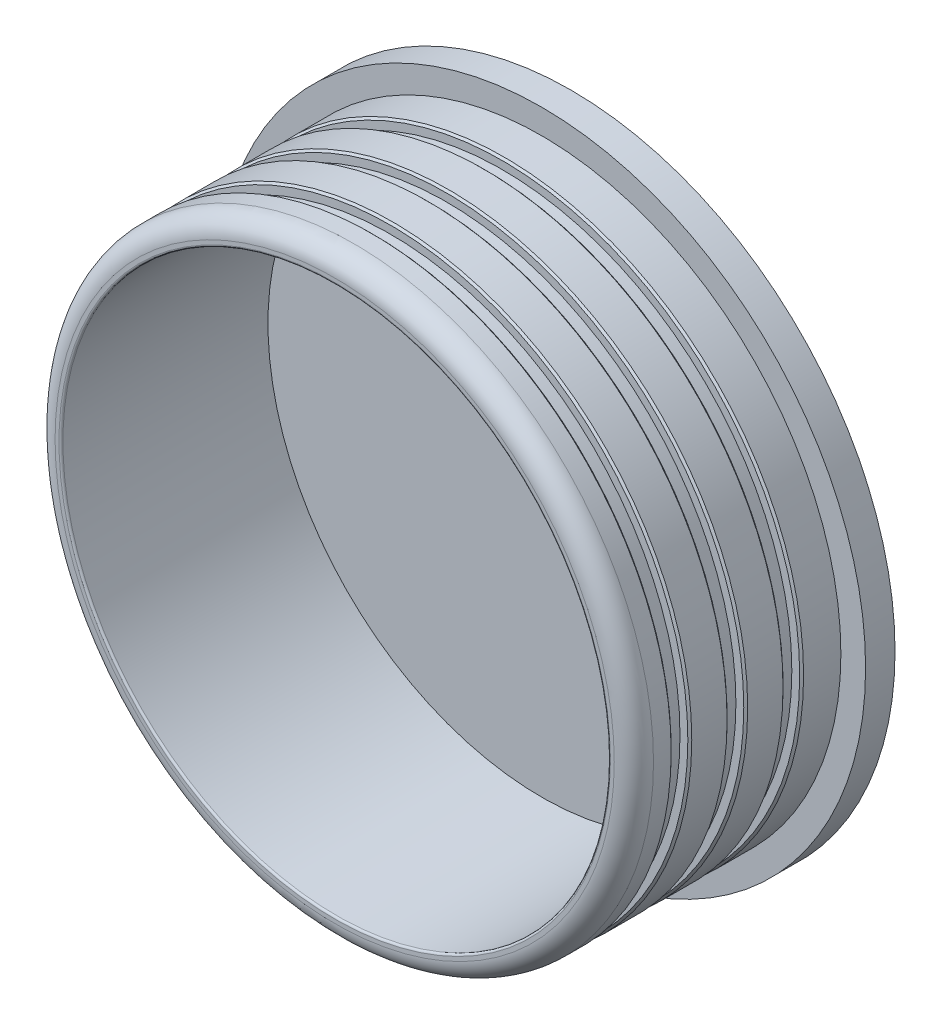
ISO-10303-21;
HEADER;
FILE_DESCRIPTION(('STEP AP214'),'2;1');
FILE_NAME('part.step','',(''),(''),'','','');
FILE_SCHEMA(('AUTOMOTIVE_DESIGN { 1 0 10303 214 1 1 1 1 }'));
ENDSEC;
DATA;
#1=APPLICATION_CONTEXT('core data for automotive mechanical design processes');
#2=APPLICATION_PROTOCOL_DEFINITION('international standard','automotive_design',2000,#1);
#3=PRODUCT_CONTEXT('',#1,'mechanical');
#4=PRODUCT('Part','Part','',(#3));
#5=PRODUCT_RELATED_PRODUCT_CATEGORY('part','',(#4));
#6=PRODUCT_DEFINITION_FORMATION('','',#4);
#7=PRODUCT_DEFINITION_CONTEXT('part definition',#1,'design');
#8=PRODUCT_DEFINITION('design','',#6,#7);
#9=PRODUCT_DEFINITION_SHAPE('','',#8);
#10=(LENGTH_UNIT() NAMED_UNIT(*) SI_UNIT(.MILLI.,.METRE.));
#11=(NAMED_UNIT(*) PLANE_ANGLE_UNIT() SI_UNIT($,.RADIAN.));
#12=(NAMED_UNIT(*) SI_UNIT($,.STERADIAN.) SOLID_ANGLE_UNIT());
#13=UNCERTAINTY_MEASURE_WITH_UNIT(LENGTH_MEASURE(1.E-05),#10,'distance_accuracy_value','');
#14=(GEOMETRIC_REPRESENTATION_CONTEXT(3) GLOBAL_UNCERTAINTY_ASSIGNED_CONTEXT((#13)) GLOBAL_UNIT_ASSIGNED_CONTEXT((#10,
#11,#12)) REPRESENTATION_CONTEXT('',''));
#15=CARTESIAN_POINT('',(0.,0.,0.));
#16=DIRECTION('',(0.,0.,1.));
#17=DIRECTION('',(1.,0.,0.));
#18=AXIS2_PLACEMENT_3D('',#15,#16,#17);
#19=CARTESIAN_POINT('',(0.,0.,0.));
#20=DIRECTION('',(0.,0.,1.));
#21=DIRECTION('',(1.,0.,0.));
#22=AXIS2_PLACEMENT_3D('',#19,#20,#21);
#23=CYLINDRICAL_SURFACE('',#22,73.75);
#24=CARTESIAN_POINT('',(0.,0.,-14.25));
#25=DIRECTION('',(0.,0.,1.));
#26=DIRECTION('',(1.,0.,0.));
#27=AXIS2_PLACEMENT_3D('',#24,#25,#26);
#28=CIRCLE('',#27,73.75);
#29=CARTESIAN_POINT('',(73.75,0.,-14.25));
#30=VERTEX_POINT('',#29);
#31=EDGE_CURVE('E150',#30,#30,#28,.T.);
#32=ORIENTED_EDGE('',*,*,#31,.T.);
#33=EDGE_LOOP('',(#32));
#34=FACE_BOUND('',#33,.T.);
#35=CARTESIAN_POINT('',(0.,0.,-9.99999999999998));
#36=DIRECTION('',(0.,0.,1.));
#37=DIRECTION('',(1.,0.,0.));
#38=AXIS2_PLACEMENT_3D('',#35,#36,#37);
#39=CIRCLE('',#38,73.75);
#40=CARTESIAN_POINT('',(73.75,0.,-9.99999999999998));
#41=VERTEX_POINT('',#40);
#42=EDGE_CURVE('E114',#41,#41,#39,.T.);
#43=ORIENTED_EDGE('',*,*,#42,.F.);
#44=EDGE_LOOP('',(#43));
#45=FACE_BOUND('',#44,.T.);
#46=ADVANCED_FACE('F42',(#34,#45),#23,.T.);
#47=CARTESIAN_POINT('',(76.25,0.,-9.99999999999998));
#48=DIRECTION('',(0.,0.,-1.));
#49=DIRECTION('',(-1.,0.,0.));
#50=AXIS2_PLACEMENT_3D('',#47,#48,#49);
#51=PLANE('',#50);
#52=CARTESIAN_POINT('',(0.,0.,-9.99999999999998));
#53=DIRECTION('',(0.,0.,-1.));
#54=DIRECTION('',(-1.,0.,0.));
#55=AXIS2_PLACEMENT_3D('',#52,#53,#54);
#56=CIRCLE('',#55,75.75);
#57=CARTESIAN_POINT('',(-75.75,0.,-9.99999999999998));
#58=VERTEX_POINT('',#57);
#59=EDGE_CURVE('E106',#58,#58,#56,.T.);
#60=ORIENTED_EDGE('',*,*,#59,.T.);
#61=EDGE_LOOP('',(#60));
#62=FACE_BOUND('',#61,.T.);
#63=ORIENTED_EDGE('',*,*,#42,.T.);
#64=EDGE_LOOP('',(#63));
#65=FACE_BOUND('',#64,.T.);
#66=ADVANCED_FACE('F174',(#62,#65),#51,.T.);
#67=CARTESIAN_POINT('',(0.,0.,0.));
#68=DIRECTION('',(0.,0.,1.));
#69=DIRECTION('',(1.,0.,0.));
#70=AXIS2_PLACEMENT_3D('',#67,#68,#69);
#71=CYLINDRICAL_SURFACE('',#70,76.25);
#72=CARTESIAN_POINT('',(0.,0.,-5.));
#73=DIRECTION('',(0.,0.,1.));
#74=DIRECTION('',(1.,0.,0.));
#75=AXIS2_PLACEMENT_3D('',#72,#73,#74);
#76=CIRCLE('',#75,76.25);
#77=CARTESIAN_POINT('',(76.25,0.,-5.));
#78=VERTEX_POINT('',#77);
#79=EDGE_CURVE('E55',#78,#78,#76,.F.);
#80=ORIENTED_EDGE('',*,*,#79,.T.);
#81=EDGE_LOOP('',(#80));
#82=FACE_BOUND('',#81,.T.);
#83=CARTESIAN_POINT('',(0.,0.,-9.49999999999995));
#84=DIRECTION('',(0.,0.,-1.));
#85=DIRECTION('',(-1.,0.,0.));
#86=AXIS2_PLACEMENT_3D('',#83,#84,#85);
#87=CIRCLE('',#86,76.25);
#88=CARTESIAN_POINT('',(-76.25,0.,-9.49999999999995));
#89=VERTEX_POINT('',#88);
#90=EDGE_CURVE('E110',#89,#89,#87,.F.);
#91=ORIENTED_EDGE('',*,*,#90,.T.);
#92=EDGE_LOOP('',(#91));
#93=FACE_BOUND('',#92,.T.);
#94=ADVANCED_FACE('F179',(#82,#93),#71,.T.);
#95=CARTESIAN_POINT('',(69.75,0.,0.));
#96=DIRECTION('',(0.,0.,1.));
#97=DIRECTION('',(1.,0.,0.));
#98=AXIS2_PLACEMENT_3D('',#95,#96,#97);
#99=PLANE('',#98);
#100=CARTESIAN_POINT('',(0.,0.,0.));
#101=DIRECTION('',(0.,0.,1.));
#102=DIRECTION('',(1.,0.,0.));
#103=AXIS2_PLACEMENT_3D('',#100,#101,#102);
#104=CIRCLE('',#103,70.25);
#105=CARTESIAN_POINT('',(70.25,0.,0.));
#106=VERTEX_POINT('',#105);
#107=EDGE_CURVE('E10',#106,#106,#104,.F.);
#108=ORIENTED_EDGE('',*,*,#107,.T.);
#109=EDGE_LOOP('',(#108));
#110=FACE_BOUND('',#109,.T.);
#111=CARTESIAN_POINT('',(0.,0.,0.));
#112=DIRECTION('',(0.,0.,1.));
#113=DIRECTION('',(1.,0.,0.));
#114=AXIS2_PLACEMENT_3D('',#111,#112,#113);
#115=CIRCLE('',#114,71.25);
#116=CARTESIAN_POINT('',(71.25,0.,0.));
#117=VERTEX_POINT('',#116);
#118=EDGE_CURVE('E60',#117,#117,#115,.T.);
#119=ORIENTED_EDGE('',*,*,#118,.T.);
#120=EDGE_LOOP('',(#119));
#121=FACE_BOUND('',#120,.T.);
#122=ADVANCED_FACE('F231',(#110,#121),#99,.T.);
#123=CARTESIAN_POINT('',(0.,0.,0.));
#124=DIRECTION('',(0.,0.,1.));
#125=DIRECTION('',(1.,0.,0.));
#126=AXIS2_PLACEMENT_3D('',#123,#124,#125);
#127=CYLINDRICAL_SURFACE('',#126,69.75);
#128=CARTESIAN_POINT('',(0.,0.,-0.5));
#129=DIRECTION('',(0.,0.,1.));
#130=DIRECTION('',(1.,0.,0.));
#131=AXIS2_PLACEMENT_3D('',#128,#129,#130);
#132=CIRCLE('',#131,69.75);
#133=CARTESIAN_POINT('',(69.75,0.,-0.5));
#134=VERTEX_POINT('',#133);
#135=EDGE_CURVE('E50',#134,#134,#132,.T.);
#136=ORIENTED_EDGE('',*,*,#135,.T.);
#137=EDGE_LOOP('',(#136));
#138=FACE_BOUND('',#137,.T.);
#139=CARTESIAN_POINT('',(0.,0.,-52.75));
#140=DIRECTION('',(0.,0.,1.));
#141=DIRECTION('',(1.,0.,0.));
#142=AXIS2_PLACEMENT_3D('',#139,#140,#141);
#143=CIRCLE('',#142,69.75);
#144=CARTESIAN_POINT('',(69.75,0.,-52.75));
#145=VERTEX_POINT('',#144);
#146=EDGE_CURVE('E118',#145,#145,#143,.T.);
#147=ORIENTED_EDGE('',*,*,#146,.F.);
#148=EDGE_LOOP('',(#147));
#149=FACE_BOUND('',#148,.T.);
#150=ADVANCED_FACE('F233',(#138,#149),#127,.F.);
#151=CARTESIAN_POINT('',(0.,0.,-52.75));
#152=DIRECTION('',(0.,0.,1.));
#153=DIRECTION('',(1.,0.,0.));
#154=AXIS2_PLACEMENT_3D('',#151,#152,#153);
#155=PLANE('',#154);
#156=ORIENTED_EDGE('',*,*,#146,.T.);
#157=EDGE_LOOP('',(#156));
#158=FACE_BOUND('',#157,.T.);
#159=ADVANCED_FACE('F239',(#158),#155,.T.);
#160=CARTESIAN_POINT('',(82.55,0.,-60.25));
#161=DIRECTION('',(0.,0.,-1.));
#162=DIRECTION('',(-1.,0.,0.));
#163=AXIS2_PLACEMENT_3D('',#160,#161,#162);
#164=PLANE('',#163);
#165=CARTESIAN_POINT('',(0.,0.,-60.25));
#166=DIRECTION('',(0.,0.,1.));
#167=DIRECTION('',(1.,0.,0.));
#168=AXIS2_PLACEMENT_3D('',#165,#166,#167);
#169=CIRCLE('',#168,82.55);
#170=CARTESIAN_POINT('',(82.55,0.,-60.25));
#171=VERTEX_POINT('',#170);
#172=EDGE_CURVE('E122',#171,#171,#169,.T.);
#173=ORIENTED_EDGE('',*,*,#172,.F.);
#174=EDGE_LOOP('',(#173));
#175=FACE_BOUND('',#174,.T.);
#176=ADVANCED_FACE('F245',(#175),#164,.T.);
#177=CARTESIAN_POINT('',(0.,0.,0.));
#178=DIRECTION('',(0.,0.,1.));
#179=DIRECTION('',(1.,0.,0.));
#180=AXIS2_PLACEMENT_3D('',#177,#178,#179);
#181=CYLINDRICAL_SURFACE('',#180,82.55);
#182=ORIENTED_EDGE('',*,*,#172,.T.);
#183=EDGE_LOOP('',(#182));
#184=FACE_BOUND('',#183,.T.);
#185=CARTESIAN_POINT('',(0.,0.,-52.75));
#186=DIRECTION('',(0.,0.,1.));
#187=DIRECTION('',(1.,0.,0.));
#188=AXIS2_PLACEMENT_3D('',#185,#186,#187);
#189=CIRCLE('',#188,82.55);
#190=CARTESIAN_POINT('',(82.55,0.,-52.75));
#191=VERTEX_POINT('',#190);
#192=EDGE_CURVE('E126',#191,#191,#189,.T.);
#193=ORIENTED_EDGE('',*,*,#192,.F.);
#194=EDGE_LOOP('',(#193));
#195=FACE_BOUND('',#194,.T.);
#196=ADVANCED_FACE('F249',(#184,#195),#181,.T.);
#197=CARTESIAN_POINT('',(76.25,0.,-52.75));
#198=DIRECTION('',(0.,0.,1.));
#199=DIRECTION('',(1.,0.,0.));
#200=AXIS2_PLACEMENT_3D('',#197,#198,#199);
#201=PLANE('',#200);
#202=ORIENTED_EDGE('',*,*,#192,.T.);
#203=EDGE_LOOP('',(#202));
#204=FACE_BOUND('',#203,.T.);
#205=CARTESIAN_POINT('',(0.,0.,-52.75));
#206=DIRECTION('',(0.,0.,1.));
#207=DIRECTION('',(1.,0.,0.));
#208=AXIS2_PLACEMENT_3D('',#205,#206,#207);
#209=CIRCLE('',#208,76.25);
#210=CARTESIAN_POINT('',(76.25,0.,-52.75));
#211=VERTEX_POINT('',#210);
#212=EDGE_CURVE('E130',#211,#211,#209,.T.);
#213=ORIENTED_EDGE('',*,*,#212,.F.);
#214=EDGE_LOOP('',(#213));
#215=FACE_BOUND('',#214,.T.);
#216=ADVANCED_FACE('F253',(#204,#215),#201,.T.);
#217=CARTESIAN_POINT('',(0.,0.,0.));
#218=DIRECTION('',(0.,0.,1.));
#219=DIRECTION('',(1.,0.,0.));
#220=AXIS2_PLACEMENT_3D('',#217,#218,#219);
#221=CYLINDRICAL_SURFACE('',#220,76.25);
#222=CARTESIAN_POINT('',(0.,0.,-43.2499999999999));
#223=DIRECTION('',(0.,0.,1.));
#224=DIRECTION('',(1.,0.,0.));
#225=AXIS2_PLACEMENT_3D('',#222,#223,#224);
#226=CIRCLE('',#225,76.25);
#227=CARTESIAN_POINT('',(76.25,0.,-43.2499999999999));
#228=VERTEX_POINT('',#227);
#229=EDGE_CURVE('E70',#228,#228,#226,.F.);
#230=ORIENTED_EDGE('',*,*,#229,.T.);
#231=EDGE_LOOP('',(#230));
#232=FACE_BOUND('',#231,.T.);
#233=ORIENTED_EDGE('',*,*,#212,.T.);
#234=EDGE_LOOP('',(#233));
#235=FACE_BOUND('',#234,.T.);
#236=ADVANCED_FACE('F257',(#232,#235),#221,.T.);
#237=CARTESIAN_POINT('',(73.75,0.,-42.75));
#238=DIRECTION('',(0.,0.,1.));
#239=DIRECTION('',(1.,0.,0.));
#240=AXIS2_PLACEMENT_3D('',#237,#238,#239);
#241=PLANE('',#240);
#242=CARTESIAN_POINT('',(0.,0.,-42.75));
#243=DIRECTION('',(0.,0.,1.));
#244=DIRECTION('',(1.,0.,0.));
#245=AXIS2_PLACEMENT_3D('',#242,#243,#244);
#246=CIRCLE('',#245,75.75);
#247=CARTESIAN_POINT('',(75.75,0.,-42.75));
#248=VERTEX_POINT('',#247);
#249=EDGE_CURVE('E74',#248,#248,#246,.T.);
#250=ORIENTED_EDGE('',*,*,#249,.T.);
#251=EDGE_LOOP('',(#250));
#252=FACE_BOUND('',#251,.T.);
#253=CARTESIAN_POINT('',(0.,0.,-42.75));
#254=DIRECTION('',(0.,0.,1.));
#255=DIRECTION('',(1.,0.,0.));
#256=AXIS2_PLACEMENT_3D('',#253,#254,#255);
#257=CIRCLE('',#256,73.75);
#258=CARTESIAN_POINT('',(73.75,0.,-42.75));
#259=VERTEX_POINT('',#258);
#260=EDGE_CURVE('E134',#259,#259,#257,.T.);
#261=ORIENTED_EDGE('',*,*,#260,.F.);
#262=EDGE_LOOP('',(#261));
#263=FACE_BOUND('',#262,.T.);
#264=ADVANCED_FACE('F261',(#252,#263),#241,.T.);
#265=CARTESIAN_POINT('',(0.,0.,0.));
#266=DIRECTION('',(0.,0.,1.));
#267=DIRECTION('',(1.,0.,0.));
#268=AXIS2_PLACEMENT_3D('',#265,#266,#267);
#269=CYLINDRICAL_SURFACE('',#268,73.75);
#270=ORIENTED_EDGE('',*,*,#260,.T.);
#271=EDGE_LOOP('',(#270));
#272=FACE_BOUND('',#271,.T.);
#273=CARTESIAN_POINT('',(0.,0.,-38.5));
#274=DIRECTION('',(0.,0.,1.));
#275=DIRECTION('',(1.,0.,0.));
#276=AXIS2_PLACEMENT_3D('',#273,#274,#275);
#277=CIRCLE('',#276,73.75);
#278=CARTESIAN_POINT('',(73.75,0.,-38.5));
#279=VERTEX_POINT('',#278);
#280=EDGE_CURVE('E138',#279,#279,#277,.T.);
#281=ORIENTED_EDGE('',*,*,#280,.F.);
#282=EDGE_LOOP('',(#281));
#283=FACE_BOUND('',#282,.T.);
#284=ADVANCED_FACE('F265',(#272,#283),#269,.T.);
#285=CARTESIAN_POINT('',(76.25,0.,-38.5));
#286=DIRECTION('',(0.,0.,-1.));
#287=DIRECTION('',(-1.,0.,0.));
#288=AXIS2_PLACEMENT_3D('',#285,#286,#287);
#289=PLANE('',#288);
#290=CARTESIAN_POINT('',(0.,0.,-38.5));
#291=DIRECTION('',(0.,0.,-1.));
#292=DIRECTION('',(-1.,0.,0.));
#293=AXIS2_PLACEMENT_3D('',#290,#291,#292);
#294=CIRCLE('',#293,75.75);
#295=CARTESIAN_POINT('',(-75.75,0.,-38.5));
#296=VERTEX_POINT('',#295);
#297=EDGE_CURVE('E66',#296,#296,#294,.T.);
#298=ORIENTED_EDGE('',*,*,#297,.T.);
#299=EDGE_LOOP('',(#298));
#300=FACE_BOUND('',#299,.T.);
#301=ORIENTED_EDGE('',*,*,#280,.T.);
#302=EDGE_LOOP('',(#301));
#303=FACE_BOUND('',#302,.T.);
#304=ADVANCED_FACE('F269',(#300,#303),#289,.T.);
#305=CARTESIAN_POINT('',(0.,0.,0.));
#306=DIRECTION('',(0.,0.,1.));
#307=DIRECTION('',(1.,0.,0.));
#308=AXIS2_PLACEMENT_3D('',#305,#306,#307);
#309=CYLINDRICAL_SURFACE('',#308,76.25);
#310=CARTESIAN_POINT('',(0.,0.,-29.));
#311=DIRECTION('',(0.,0.,1.));
#312=DIRECTION('',(1.,0.,0.));
#313=AXIS2_PLACEMENT_3D('',#310,#311,#312);
#314=CIRCLE('',#313,76.25);
#315=CARTESIAN_POINT('',(76.25,0.,-29.));
#316=VERTEX_POINT('',#315);
#317=EDGE_CURVE('E78',#316,#316,#314,.F.);
#318=ORIENTED_EDGE('',*,*,#317,.T.);
#319=EDGE_LOOP('',(#318));
#320=FACE_BOUND('',#319,.T.);
#321=CARTESIAN_POINT('',(0.,0.,-38.));
#322=DIRECTION('',(0.,0.,-1.));
#323=DIRECTION('',(-1.,0.,0.));
#324=AXIS2_PLACEMENT_3D('',#321,#322,#323);
#325=CIRCLE('',#324,76.25);
#326=CARTESIAN_POINT('',(-76.25,0.,-38.));
#327=VERTEX_POINT('',#326);
#328=EDGE_CURVE('E82',#327,#327,#325,.F.);
#329=ORIENTED_EDGE('',*,*,#328,.T.);
#330=EDGE_LOOP('',(#329));
#331=FACE_BOUND('',#330,.T.);
#332=ADVANCED_FACE('F273',(#320,#331),#309,.T.);
#333=CARTESIAN_POINT('',(73.75,0.,-28.5));
#334=DIRECTION('',(0.,0.,1.));
#335=DIRECTION('',(1.,0.,0.));
#336=AXIS2_PLACEMENT_3D('',#333,#334,#335);
#337=PLANE('',#336);
#338=CARTESIAN_POINT('',(0.,0.,-28.5));
#339=DIRECTION('',(0.,0.,1.));
#340=DIRECTION('',(1.,0.,0.));
#341=AXIS2_PLACEMENT_3D('',#338,#339,#340);
#342=CIRCLE('',#341,75.75);
#343=CARTESIAN_POINT('',(75.75,0.,-28.5));
#344=VERTEX_POINT('',#343);
#345=EDGE_CURVE('E86',#344,#344,#342,.T.);
#346=ORIENTED_EDGE('',*,*,#345,.T.);
#347=EDGE_LOOP('',(#346));
#348=FACE_BOUND('',#347,.T.);
#349=CARTESIAN_POINT('',(0.,0.,-28.5));
#350=DIRECTION('',(0.,0.,1.));
#351=DIRECTION('',(1.,0.,0.));
#352=AXIS2_PLACEMENT_3D('',#349,#350,#351);
#353=CIRCLE('',#352,73.75);
#354=CARTESIAN_POINT('',(73.75,0.,-28.5));
#355=VERTEX_POINT('',#354);
#356=EDGE_CURVE('E142',#355,#355,#353,.T.);
#357=ORIENTED_EDGE('',*,*,#356,.F.);
#358=EDGE_LOOP('',(#357));
#359=FACE_BOUND('',#358,.T.);
#360=ADVANCED_FACE('F277',(#348,#359),#337,.T.);
#361=CARTESIAN_POINT('',(0.,0.,0.));
#362=DIRECTION('',(0.,0.,1.));
#363=DIRECTION('',(1.,0.,0.));
#364=AXIS2_PLACEMENT_3D('',#361,#362,#363);
#365=CYLINDRICAL_SURFACE('',#364,73.75);
#366=ORIENTED_EDGE('',*,*,#356,.T.);
#367=EDGE_LOOP('',(#366));
#368=FACE_BOUND('',#367,.T.);
#369=CARTESIAN_POINT('',(0.,0.,-24.25));
#370=DIRECTION('',(0.,0.,1.));
#371=DIRECTION('',(1.,0.,0.));
#372=AXIS2_PLACEMENT_3D('',#369,#370,#371);
#373=CIRCLE('',#372,73.75);
#374=CARTESIAN_POINT('',(73.75,0.,-24.25));
#375=VERTEX_POINT('',#374);
#376=EDGE_CURVE('E146',#375,#375,#373,.T.);
#377=ORIENTED_EDGE('',*,*,#376,.F.);
#378=EDGE_LOOP('',(#377));
#379=FACE_BOUND('',#378,.T.);
#380=ADVANCED_FACE('F281',(#368,#379),#365,.T.);
#381=CARTESIAN_POINT('',(76.25,0.,-24.25));
#382=DIRECTION('',(0.,0.,-1.));
#383=DIRECTION('',(-1.,0.,0.));
#384=AXIS2_PLACEMENT_3D('',#381,#382,#383);
#385=PLANE('',#384);
#386=CARTESIAN_POINT('',(0.,0.,-24.25));
#387=DIRECTION('',(0.,0.,-1.));
#388=DIRECTION('',(-1.,0.,0.));
#389=AXIS2_PLACEMENT_3D('',#386,#387,#388);
#390=CIRCLE('',#389,75.75);
#391=CARTESIAN_POINT('',(-75.75,0.,-24.25));
#392=VERTEX_POINT('',#391);
#393=EDGE_CURVE('E90',#392,#392,#390,.T.);
#394=ORIENTED_EDGE('',*,*,#393,.T.);
#395=EDGE_LOOP('',(#394));
#396=FACE_BOUND('',#395,.T.);
#397=ORIENTED_EDGE('',*,*,#376,.T.);
#398=EDGE_LOOP('',(#397));
#399=FACE_BOUND('',#398,.T.);
#400=ADVANCED_FACE('F170',(#396,#399),#385,.T.);
#401=CARTESIAN_POINT('',(0.,0.,0.));
#402=DIRECTION('',(0.,0.,1.));
#403=DIRECTION('',(1.,0.,0.));
#404=AXIS2_PLACEMENT_3D('',#401,#402,#403);
#405=CYLINDRICAL_SURFACE('',#404,76.25);
#406=CARTESIAN_POINT('',(0.,0.,-14.75));
#407=DIRECTION('',(0.,0.,1.));
#408=DIRECTION('',(1.,0.,0.));
#409=AXIS2_PLACEMENT_3D('',#406,#407,#408);
#410=CIRCLE('',#409,76.25);
#411=CARTESIAN_POINT('',(76.25,0.,-14.75));
#412=VERTEX_POINT('',#411);
#413=EDGE_CURVE('E94',#412,#412,#410,.F.);
#414=ORIENTED_EDGE('',*,*,#413,.T.);
#415=EDGE_LOOP('',(#414));
#416=FACE_BOUND('',#415,.T.);
#417=CARTESIAN_POINT('',(0.,0.,-23.75));
#418=DIRECTION('',(0.,0.,-1.));
#419=DIRECTION('',(-1.,0.,0.));
#420=AXIS2_PLACEMENT_3D('',#417,#418,#419);
#421=CIRCLE('',#420,76.25);
#422=CARTESIAN_POINT('',(-76.25,0.,-23.75));
#423=VERTEX_POINT('',#422);
#424=EDGE_CURVE('E98',#423,#423,#421,.F.);
#425=ORIENTED_EDGE('',*,*,#424,.T.);
#426=EDGE_LOOP('',(#425));
#427=FACE_BOUND('',#426,.T.);
#428=ADVANCED_FACE('F160',(#416,#427),#405,.T.);
#429=CARTESIAN_POINT('',(73.75,0.,-14.25));
#430=DIRECTION('',(0.,0.,1.));
#431=DIRECTION('',(1.,0.,0.));
#432=AXIS2_PLACEMENT_3D('',#429,#430,#431);
#433=PLANE('',#432);
#434=CARTESIAN_POINT('',(0.,0.,-14.25));
#435=DIRECTION('',(0.,0.,1.));
#436=DIRECTION('',(1.,0.,0.));
#437=AXIS2_PLACEMENT_3D('',#434,#435,#436);
#438=CIRCLE('',#437,75.75);
#439=CARTESIAN_POINT('',(75.75,0.,-14.25));
#440=VERTEX_POINT('',#439);
#441=EDGE_CURVE('E102',#440,#440,#438,.T.);
#442=ORIENTED_EDGE('',*,*,#441,.T.);
#443=EDGE_LOOP('',(#442));
#444=FACE_BOUND('',#443,.T.);
#445=ORIENTED_EDGE('',*,*,#31,.F.);
#446=EDGE_LOOP('',(#445));
#447=FACE_BOUND('',#446,.T.);
#448=ADVANCED_FACE('F157',(#444,#447),#433,.T.);
#449=CARTESIAN_POINT('',(0.,0.,-9.49999999999995));
#450=DIRECTION('',(0.,0.,1.));
#451=DIRECTION('',(1.,0.,0.));
#452=AXIS2_PLACEMENT_3D('',#449,#450,#451);
#453=CONICAL_SURFACE('',#452,76.25,0.785398163397448);
#454=ORIENTED_EDGE('',*,*,#59,.F.);
#455=EDGE_LOOP('',(#454));
#456=FACE_BOUND('',#455,.T.);
#457=ORIENTED_EDGE('',*,*,#90,.F.);
#458=EDGE_LOOP('',(#457));
#459=FACE_BOUND('',#458,.T.);
#460=ADVANCED_FACE('F159',(#456,#459),#453,.T.);
#461=CARTESIAN_POINT('',(0.,0.,-14.25));
#462=DIRECTION('',(0.,0.,-1.));
#463=DIRECTION('',(-1.,0.,0.));
#464=AXIS2_PLACEMENT_3D('',#461,#462,#463);
#465=CONICAL_SURFACE('',#464,75.75,0.785398163397462);
#466=ORIENTED_EDGE('',*,*,#413,.F.);
#467=EDGE_LOOP('',(#466));
#468=FACE_BOUND('',#467,.T.);
#469=ORIENTED_EDGE('',*,*,#441,.F.);
#470=EDGE_LOOP('',(#469));
#471=FACE_BOUND('',#470,.T.);
#472=ADVANCED_FACE('F167',(#468,#471),#465,.T.);
#473=CARTESIAN_POINT('',(0.,0.,-23.75));
#474=DIRECTION('',(0.,0.,1.));
#475=DIRECTION('',(1.,0.,0.));
#476=AXIS2_PLACEMENT_3D('',#473,#474,#475);
#477=CONICAL_SURFACE('',#476,76.25,0.785398163397448);
#478=ORIENTED_EDGE('',*,*,#393,.F.);
#479=EDGE_LOOP('',(#478));
#480=FACE_BOUND('',#479,.T.);
#481=ORIENTED_EDGE('',*,*,#424,.F.);
#482=EDGE_LOOP('',(#481));
#483=FACE_BOUND('',#482,.T.);
#484=ADVANCED_FACE('F193',(#480,#483),#477,.T.);
#485=CARTESIAN_POINT('',(0.,0.,-28.5));
#486=DIRECTION('',(0.,0.,-1.));
#487=DIRECTION('',(-1.,0.,0.));
#488=AXIS2_PLACEMENT_3D('',#485,#486,#487);
#489=CONICAL_SURFACE('',#488,75.75,0.785398163397462);
#490=ORIENTED_EDGE('',*,*,#317,.F.);
#491=EDGE_LOOP('',(#490));
#492=FACE_BOUND('',#491,.T.);
#493=ORIENTED_EDGE('',*,*,#345,.F.);
#494=EDGE_LOOP('',(#493));
#495=FACE_BOUND('',#494,.T.);
#496=ADVANCED_FACE('F200',(#492,#495),#489,.T.);
#497=CARTESIAN_POINT('',(0.,0.,-42.75));
#498=DIRECTION('',(0.,0.,-1.));
#499=DIRECTION('',(-1.,0.,0.));
#500=AXIS2_PLACEMENT_3D('',#497,#498,#499);
#501=CONICAL_SURFACE('',#500,75.75,0.785398163397462);
#502=ORIENTED_EDGE('',*,*,#229,.F.);
#503=EDGE_LOOP('',(#502));
#504=FACE_BOUND('',#503,.T.);
#505=ORIENTED_EDGE('',*,*,#249,.F.);
#506=EDGE_LOOP('',(#505));
#507=FACE_BOUND('',#506,.T.);
#508=ADVANCED_FACE('F207',(#504,#507),#501,.T.);
#509=CARTESIAN_POINT('',(0.,0.,-38.));
#510=DIRECTION('',(0.,0.,1.));
#511=DIRECTION('',(1.,0.,0.));
#512=AXIS2_PLACEMENT_3D('',#509,#510,#511);
#513=CONICAL_SURFACE('',#512,76.25,0.785398163397448);
#514=ORIENTED_EDGE('',*,*,#297,.F.);
#515=EDGE_LOOP('',(#514));
#516=FACE_BOUND('',#515,.T.);
#517=ORIENTED_EDGE('',*,*,#328,.F.);
#518=EDGE_LOOP('',(#517));
#519=FACE_BOUND('',#518,.T.);
#520=ADVANCED_FACE('F214',(#516,#519),#513,.T.);
#521=CARTESIAN_POINT('',(0.,0.,-5.));
#522=DIRECTION('',(0.,0.,1.));
#523=DIRECTION('',(1.,0.,0.));
#524=AXIS2_PLACEMENT_3D('',#521,#522,#523);
#525=TOROIDAL_SURFACE('',#524,71.25,5.);
#526=ORIENTED_EDGE('',*,*,#79,.F.);
#527=EDGE_LOOP('',(#526));
#528=FACE_BOUND('',#527,.T.);
#529=ORIENTED_EDGE('',*,*,#118,.F.);
#530=EDGE_LOOP('',(#529));
#531=FACE_BOUND('',#530,.T.);
#532=ADVANCED_FACE('F219',(#528,#531),#525,.T.);
#533=CARTESIAN_POINT('',(0.,0.,-0.5));
#534=DIRECTION('',(0.,0.,1.));
#535=DIRECTION('',(1.,0.,0.));
#536=AXIS2_PLACEMENT_3D('',#533,#534,#535);
#537=TOROIDAL_SURFACE('',#536,70.25,0.5);
#538=ORIENTED_EDGE('',*,*,#107,.F.);
#539=EDGE_LOOP('',(#538));
#540=FACE_BOUND('',#539,.T.);
#541=ORIENTED_EDGE('',*,*,#135,.F.);
#542=EDGE_LOOP('',(#541));
#543=FACE_BOUND('',#542,.T.);
#544=ADVANCED_FACE('F44',(#540,#543),#537,.T.);
#545=CLOSED_SHELL('',(#46,#66,#94,#122,#150,#159,#176,#196,#216,#236,#264,#284,#304,#332,#360,
#380,#400,#428,#448,#460,#472,#484,#496,#508,#520,#532,#544));
#546=MANIFOLD_SOLID_BREP('B2',#545);
#547=ADVANCED_BREP_SHAPE_REPRESENTATION('',(#18,#546),#14);
#548=SHAPE_DEFINITION_REPRESENTATION(#9,#547);
ENDSEC;
END-ISO-10303-21;
